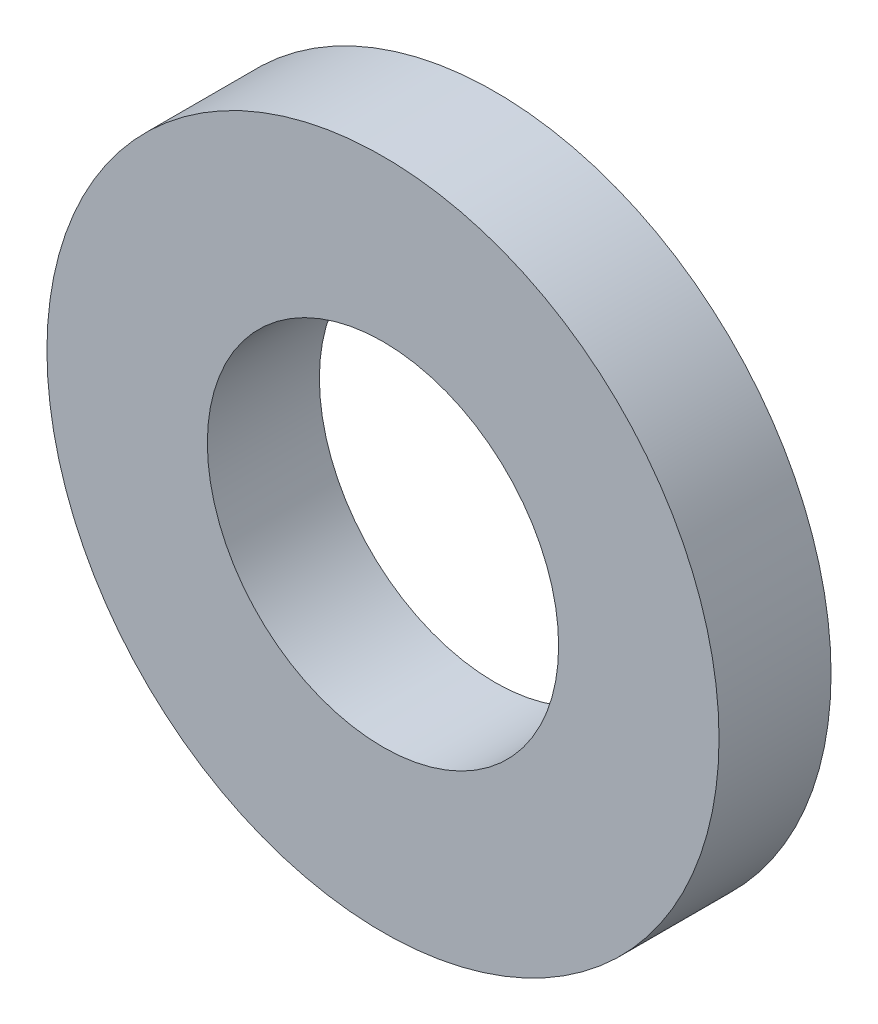
ISO-10303-21;
HEADER;
FILE_DESCRIPTION(('STEP AP214'),'2;1');
FILE_NAME('part.step','',(''),(''),'','','');
FILE_SCHEMA(('AUTOMOTIVE_DESIGN { 1 0 10303 214 1 1 1 1 }'));
ENDSEC;
DATA;
#1=APPLICATION_CONTEXT('core data for automotive mechanical design processes');
#2=APPLICATION_PROTOCOL_DEFINITION('international standard','automotive_design',2000,#1);
#3=PRODUCT_CONTEXT('',#1,'mechanical');
#4=PRODUCT('Part','Part','',(#3));
#5=PRODUCT_RELATED_PRODUCT_CATEGORY('part','',(#4));
#6=PRODUCT_DEFINITION_FORMATION('','',#4);
#7=PRODUCT_DEFINITION_CONTEXT('part definition',#1,'design');
#8=PRODUCT_DEFINITION('design','',#6,#7);
#9=PRODUCT_DEFINITION_SHAPE('','',#8);
#10=(LENGTH_UNIT() NAMED_UNIT(*) SI_UNIT(.MILLI.,.METRE.));
#11=(NAMED_UNIT(*) PLANE_ANGLE_UNIT() SI_UNIT($,.RADIAN.));
#12=(NAMED_UNIT(*) SI_UNIT($,.STERADIAN.) SOLID_ANGLE_UNIT());
#13=UNCERTAINTY_MEASURE_WITH_UNIT(LENGTH_MEASURE(1.E-05),#10,'distance_accuracy_value','');
#14=(GEOMETRIC_REPRESENTATION_CONTEXT(3) GLOBAL_UNCERTAINTY_ASSIGNED_CONTEXT((#13)) GLOBAL_UNIT_ASSIGNED_CONTEXT((#10,
#11,#12)) REPRESENTATION_CONTEXT('',''));
#15=CARTESIAN_POINT('',(0.,0.,0.));
#16=DIRECTION('',(0.,0.,1.));
#17=DIRECTION('',(1.,0.,0.));
#18=AXIS2_PLACEMENT_3D('',#15,#16,#17);
#19=CARTESIAN_POINT('',(0.,0.,3.175));
#20=DIRECTION('',(0.,0.,-1.));
#21=DIRECTION('',(-1.,0.,0.));
#22=AXIS2_PLACEMENT_3D('',#19,#20,#21);
#23=CYLINDRICAL_SURFACE('',#22,9.525);
#24=CARTESIAN_POINT('',(0.,0.,3.175));
#25=DIRECTION('',(0.,0.,1.));
#26=DIRECTION('',(1.,0.,0.));
#27=AXIS2_PLACEMENT_3D('',#24,#25,#26);
#28=CIRCLE('',#27,9.525);
#29=CARTESIAN_POINT('',(9.525,0.,3.175));
#30=VERTEX_POINT('',#29);
#31=EDGE_CURVE('E10',#30,#30,#28,.T.);
#32=ORIENTED_EDGE('',*,*,#31,.F.);
#33=EDGE_LOOP('',(#32));
#34=FACE_BOUND('',#33,.T.);
#35=CARTESIAN_POINT('',(0.,0.,0.));
#36=DIRECTION('',(0.,0.,1.));
#37=DIRECTION('',(1.,0.,0.));
#38=AXIS2_PLACEMENT_3D('',#35,#36,#37);
#39=CIRCLE('',#38,9.525);
#40=CARTESIAN_POINT('',(9.525,0.,0.));
#41=VERTEX_POINT('',#40);
#42=EDGE_CURVE('E37',#41,#41,#39,.T.);
#43=ORIENTED_EDGE('',*,*,#42,.T.);
#44=EDGE_LOOP('',(#43));
#45=FACE_BOUND('',#44,.T.);
#46=ADVANCED_FACE('F30',(#34,#45),#23,.T.);
#47=CARTESIAN_POINT('',(0.,0.,3.175));
#48=DIRECTION('',(0.,0.,1.));
#49=DIRECTION('',(1.,0.,0.));
#50=AXIS2_PLACEMENT_3D('',#47,#48,#49);
#51=PLANE('',#50);
#52=CARTESIAN_POINT('',(0.,0.,3.175));
#53=DIRECTION('',(0.,0.,1.));
#54=DIRECTION('',(1.,0.,0.));
#55=AXIS2_PLACEMENT_3D('',#52,#53,#54);
#56=CIRCLE('',#55,4.9784);
#57=CARTESIAN_POINT('',(4.9784,0.,3.175));
#58=VERTEX_POINT('',#57);
#59=EDGE_CURVE('E42',#58,#58,#56,.T.);
#60=ORIENTED_EDGE('',*,*,#59,.F.);
#61=EDGE_LOOP('',(#60));
#62=FACE_BOUND('',#61,.T.);
#63=ORIENTED_EDGE('',*,*,#31,.T.);
#64=EDGE_LOOP('',(#63));
#65=FACE_BOUND('',#64,.T.);
#66=ADVANCED_FACE('F59',(#62,#65),#51,.T.);
#67=CARTESIAN_POINT('',(0.,0.,0.));
#68=DIRECTION('',(0.,0.,1.));
#69=DIRECTION('',(1.,0.,0.));
#70=AXIS2_PLACEMENT_3D('',#67,#68,#69);
#71=PLANE('',#70);
#72=CARTESIAN_POINT('',(0.,0.,0.));
#73=DIRECTION('',(0.,0.,1.));
#74=DIRECTION('',(1.,0.,0.));
#75=AXIS2_PLACEMENT_3D('',#72,#73,#74);
#76=CIRCLE('',#75,4.9784);
#77=CARTESIAN_POINT('',(4.9784,0.,0.));
#78=VERTEX_POINT('',#77);
#79=EDGE_CURVE('E33',#78,#78,#76,.T.);
#80=ORIENTED_EDGE('',*,*,#79,.T.);
#81=EDGE_LOOP('',(#80));
#82=FACE_BOUND('',#81,.T.);
#83=ORIENTED_EDGE('',*,*,#42,.F.);
#84=EDGE_LOOP('',(#83));
#85=FACE_BOUND('',#84,.T.);
#86=ADVANCED_FACE('F50',(#82,#85),#71,.F.);
#87=CARTESIAN_POINT('',(0.,0.,-0.0508000000000002));
#88=DIRECTION('',(0.,0.,1.));
#89=DIRECTION('',(1.,0.,0.));
#90=AXIS2_PLACEMENT_3D('',#87,#88,#89);
#91=CYLINDRICAL_SURFACE('',#90,4.9784);
#92=ORIENTED_EDGE('',*,*,#59,.T.);
#93=EDGE_LOOP('',(#92));
#94=FACE_BOUND('',#93,.T.);
#95=ORIENTED_EDGE('',*,*,#79,.F.);
#96=EDGE_LOOP('',(#95));
#97=FACE_BOUND('',#96,.T.);
#98=ADVANCED_FACE('F53',(#94,#97),#91,.F.);
#99=CLOSED_SHELL('',(#46,#66,#86,#98));
#100=MANIFOLD_SOLID_BREP('B2',#99);
#101=ADVANCED_BREP_SHAPE_REPRESENTATION('',(#18,#100),#14);
#102=SHAPE_DEFINITION_REPRESENTATION(#9,#101);
ENDSEC;
END-ISO-10303-21;
